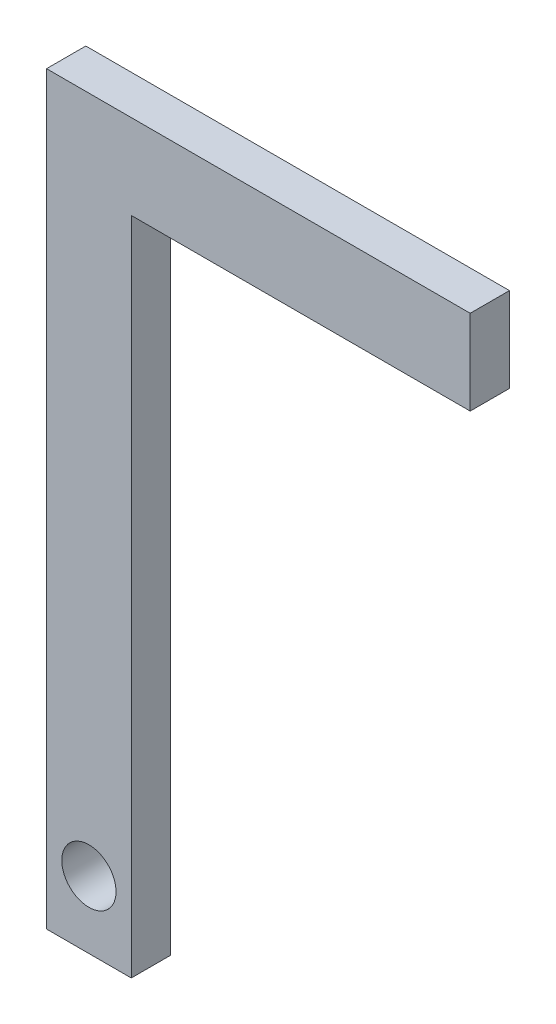
ISO-10303-21;
HEADER;
FILE_DESCRIPTION(('STEP AP214'),'2;1');
FILE_NAME('part.step','',(''),(''),'','','');
FILE_SCHEMA(('AUTOMOTIVE_DESIGN { 1 0 10303 214 1 1 1 1 }'));
ENDSEC;
DATA;
#1=APPLICATION_CONTEXT('core data for automotive mechanical design processes');
#2=APPLICATION_PROTOCOL_DEFINITION('international standard','automotive_design',2000,#1);
#3=PRODUCT_CONTEXT('',#1,'mechanical');
#4=PRODUCT('Part','Part','',(#3));
#5=PRODUCT_RELATED_PRODUCT_CATEGORY('part','',(#4));
#6=PRODUCT_DEFINITION_FORMATION('','',#4);
#7=PRODUCT_DEFINITION_CONTEXT('part definition',#1,'design');
#8=PRODUCT_DEFINITION('design','',#6,#7);
#9=PRODUCT_DEFINITION_SHAPE('','',#8);
#10=(LENGTH_UNIT() NAMED_UNIT(*) SI_UNIT(.MILLI.,.METRE.));
#11=(NAMED_UNIT(*) PLANE_ANGLE_UNIT() SI_UNIT($,.RADIAN.));
#12=(NAMED_UNIT(*) SI_UNIT($,.STERADIAN.) SOLID_ANGLE_UNIT());
#13=UNCERTAINTY_MEASURE_WITH_UNIT(LENGTH_MEASURE(1.E-05),#10,'distance_accuracy_value','');
#14=(GEOMETRIC_REPRESENTATION_CONTEXT(3) GLOBAL_UNCERTAINTY_ASSIGNED_CONTEXT((#13)) GLOBAL_UNIT_ASSIGNED_CONTEXT((#10,
#11,#12)) REPRESENTATION_CONTEXT('',''));
#15=CARTESIAN_POINT('',(0.,0.,0.));
#16=DIRECTION('',(0.,0.,1.));
#17=DIRECTION('',(1.,0.,0.));
#18=AXIS2_PLACEMENT_3D('',#15,#16,#17);
#19=CARTESIAN_POINT('',(3.71819251671082,65.9563637903829,6.95));
#20=DIRECTION('',(1.,0.,0.));
#21=DIRECTION('',(0.,1.,0.));
#22=AXIS2_PLACEMENT_3D('',#19,#20,#21);
#23=PLANE('',#22);
#24=DIRECTION('',(0.,0.,-1.));
#25=VECTOR('',#24,1.);
#26=CARTESIAN_POINT('',(3.71819251671082,50.9563637903829,6.95));
#27=LINE('',#26,#25);
#28=CARTESIAN_POINT('',(3.71819251671082,50.9563637903829,6.95));
#29=VERTEX_POINT('',#28);
#30=CARTESIAN_POINT('',(3.71819251671082,50.9563637903829,0.));
#31=VERTEX_POINT('',#30);
#32=EDGE_CURVE('E51',#29,#31,#27,.T.);
#33=ORIENTED_EDGE('',*,*,#32,.F.);
#34=DIRECTION('',(0.,-1.,0.));
#35=VECTOR('',#34,1.);
#36=CARTESIAN_POINT('',(3.71819251671082,65.9563637903829,6.95));
#37=LINE('',#36,#35);
#38=CARTESIAN_POINT('',(3.71819251671084,-65.9563637903829,6.95));
#39=VERTEX_POINT('',#38);
#40=EDGE_CURVE('E75',#29,#39,#37,.T.);
#41=ORIENTED_EDGE('',*,*,#40,.T.);
#42=DIRECTION('',(0.,0.,-1.));
#43=VECTOR('',#42,1.);
#44=CARTESIAN_POINT('',(3.71819251671084,-65.9563637903829,6.95));
#45=LINE('',#44,#43);
#46=CARTESIAN_POINT('',(3.71819251671084,-65.9563637903829,0.));
#47=VERTEX_POINT('',#46);
#48=EDGE_CURVE('E38',#39,#47,#45,.T.);
#49=ORIENTED_EDGE('',*,*,#48,.T.);
#50=DIRECTION('',(0.,-1.,0.));
#51=VECTOR('',#50,1.);
#52=CARTESIAN_POINT('',(3.71819251671082,65.9563637903829,0.));
#53=LINE('',#52,#51);
#54=EDGE_CURVE('E122',#31,#47,#53,.T.);
#55=ORIENTED_EDGE('',*,*,#54,.F.);
#56=EDGE_LOOP('',(#33,#41,#49,#55));
#57=FACE_BOUND('',#56,.T.);
#58=ADVANCED_FACE('F35',(#57),#23,.T.);
#59=CARTESIAN_POINT('',(-11.2818074832892,65.9563637903829,6.95));
#60=DIRECTION('',(0.,1.,0.));
#61=DIRECTION('',(0.,0.,1.));
#62=AXIS2_PLACEMENT_3D('',#59,#60,#61);
#63=PLANE('',#62);
#64=DIRECTION('',(1.,0.,0.));
#65=VECTOR('',#64,1.);
#66=CARTESIAN_POINT('',(-11.2818074832892,65.9563637903829,0.));
#67=LINE('',#66,#65);
#68=CARTESIAN_POINT('',(-11.2818074832892,65.9563637903829,0.));
#69=VERTEX_POINT('',#68);
#70=CARTESIAN_POINT('',(63.7181925167108,65.9563637903829,0.));
#71=VERTEX_POINT('',#70);
#72=EDGE_CURVE('E125',#69,#71,#67,.T.);
#73=ORIENTED_EDGE('',*,*,#72,.F.);
#74=DIRECTION('',(0.,0.,-1.));
#75=VECTOR('',#74,1.);
#76=CARTESIAN_POINT('',(-11.2818074832892,65.9563637903829,6.95));
#77=LINE('',#76,#75);
#78=CARTESIAN_POINT('',(-11.2818074832892,65.9563637903829,6.95));
#79=VERTEX_POINT('',#78);
#80=EDGE_CURVE('E11',#79,#69,#77,.T.);
#81=ORIENTED_EDGE('',*,*,#80,.F.);
#82=DIRECTION('',(1.,0.,0.));
#83=VECTOR('',#82,1.);
#84=CARTESIAN_POINT('',(-11.2818074832892,65.9563637903829,6.95));
#85=LINE('',#84,#83);
#86=CARTESIAN_POINT('',(63.7181925167108,65.9563637903829,6.95));
#87=VERTEX_POINT('',#86);
#88=EDGE_CURVE('E129',#79,#87,#85,.T.);
#89=ORIENTED_EDGE('',*,*,#88,.T.);
#90=DIRECTION('',(0.,0.,-1.));
#91=VECTOR('',#90,1.);
#92=CARTESIAN_POINT('',(63.7181925167108,65.9563637903829,6.95));
#93=LINE('',#92,#91);
#94=EDGE_CURVE('E110',#87,#71,#93,.T.);
#95=ORIENTED_EDGE('',*,*,#94,.T.);
#96=EDGE_LOOP('',(#73,#81,#89,#95));
#97=FACE_BOUND('',#96,.T.);
#98=ADVANCED_FACE('F146',(#97),#63,.T.);
#99=CARTESIAN_POINT('',(-11.2818074832892,65.9563637903829,6.95));
#100=DIRECTION('',(1.,0.,0.));
#101=DIRECTION('',(0.,1.,0.));
#102=AXIS2_PLACEMENT_3D('',#99,#100,#101);
#103=PLANE('',#102);
#104=DIRECTION('',(0.,-1.,0.));
#105=VECTOR('',#104,1.);
#106=CARTESIAN_POINT('',(-11.2818074832892,65.9563637903829,0.));
#107=LINE('',#106,#105);
#108=CARTESIAN_POINT('',(-11.2818074832892,-65.9563637903829,0.));
#109=VERTEX_POINT('',#108);
#110=EDGE_CURVE('E135',#69,#109,#107,.T.);
#111=ORIENTED_EDGE('',*,*,#110,.T.);
#112=DIRECTION('',(0.,0.,-1.));
#113=VECTOR('',#112,1.);
#114=CARTESIAN_POINT('',(-11.2818074832892,-65.9563637903829,6.95));
#115=LINE('',#114,#113);
#116=CARTESIAN_POINT('',(-11.2818074832892,-65.9563637903829,6.95));
#117=VERTEX_POINT('',#116);
#118=EDGE_CURVE('E43',#117,#109,#115,.T.);
#119=ORIENTED_EDGE('',*,*,#118,.F.);
#120=DIRECTION('',(0.,-1.,0.));
#121=VECTOR('',#120,1.);
#122=CARTESIAN_POINT('',(-11.2818074832892,65.9563637903829,6.95));
#123=LINE('',#122,#121);
#124=EDGE_CURVE('E127',#79,#117,#123,.T.);
#125=ORIENTED_EDGE('',*,*,#124,.F.);
#126=ORIENTED_EDGE('',*,*,#80,.T.);
#127=EDGE_LOOP('',(#111,#119,#125,#126));
#128=FACE_BOUND('',#127,.T.);
#129=ADVANCED_FACE('F147',(#128),#103,.F.);
#130=CARTESIAN_POINT('',(-11.2818074832892,-65.9563637903829,6.95));
#131=DIRECTION('',(0.,1.,0.));
#132=DIRECTION('',(0.,0.,1.));
#133=AXIS2_PLACEMENT_3D('',#130,#131,#132);
#134=PLANE('',#133);
#135=DIRECTION('',(1.,0.,0.));
#136=VECTOR('',#135,1.);
#137=CARTESIAN_POINT('',(-11.2818074832892,-65.9563637903829,0.));
#138=LINE('',#137,#136);
#139=EDGE_CURVE('E132',#109,#47,#138,.T.);
#140=ORIENTED_EDGE('',*,*,#139,.T.);
#141=ORIENTED_EDGE('',*,*,#48,.F.);
#142=DIRECTION('',(1.,0.,0.));
#143=VECTOR('',#142,1.);
#144=CARTESIAN_POINT('',(-11.2818074832892,-65.9563637903829,6.95));
#145=LINE('',#144,#143);
#146=EDGE_CURVE('E124',#117,#39,#145,.T.);
#147=ORIENTED_EDGE('',*,*,#146,.F.);
#148=ORIENTED_EDGE('',*,*,#118,.T.);
#149=EDGE_LOOP('',(#140,#141,#147,#148));
#150=FACE_BOUND('',#149,.T.);
#151=ADVANCED_FACE('F143',(#150),#134,.F.);
#152=CARTESIAN_POINT('',(0.,0.,6.95));
#153=DIRECTION('',(0.,0.,1.));
#154=DIRECTION('',(1.,0.,0.));
#155=AXIS2_PLACEMENT_3D('',#152,#153,#154);
#156=PLANE('',#155);
#157=CARTESIAN_POINT('',(-3.78180748328916,-54.0730128123559,6.95));
#158=DIRECTION('',(0.,0.,1.));
#159=DIRECTION('',(1.,0.,0.));
#160=AXIS2_PLACEMENT_3D('',#157,#158,#159);
#161=CIRCLE('',#160,4.8);
#162=CARTESIAN_POINT('',(1.01819251671084,-54.0730128123559,6.95));
#163=VERTEX_POINT('',#162);
#164=EDGE_CURVE('E119',#163,#163,#161,.T.);
#165=ORIENTED_EDGE('',*,*,#164,.F.);
#166=EDGE_LOOP('',(#165));
#167=FACE_BOUND('',#166,.T.);
#168=ORIENTED_EDGE('',*,*,#40,.F.);
#169=DIRECTION('',(1.,0.,0.));
#170=VECTOR('',#169,1.);
#171=CARTESIAN_POINT('',(3.71819251671082,50.9563637903829,6.95));
#172=LINE('',#171,#170);
#173=CARTESIAN_POINT('',(63.7181925167108,50.9563637903829,6.95));
#174=VERTEX_POINT('',#173);
#175=EDGE_CURVE('E92',#29,#174,#172,.T.);
#176=ORIENTED_EDGE('',*,*,#175,.T.);
#177=DIRECTION('',(0.,1.,0.));
#178=VECTOR('',#177,1.);
#179=CARTESIAN_POINT('',(63.7181925167108,65.9563637903829,6.95));
#180=LINE('',#179,#178);
#181=EDGE_CURVE('E97',#174,#87,#180,.T.);
#182=ORIENTED_EDGE('',*,*,#181,.T.);
#183=ORIENTED_EDGE('',*,*,#88,.F.);
#184=ORIENTED_EDGE('',*,*,#124,.T.);
#185=ORIENTED_EDGE('',*,*,#146,.T.);
#186=EDGE_LOOP('',(#168,#176,#182,#183,#184,#185));
#187=FACE_BOUND('',#186,.T.);
#188=ADVANCED_FACE('F94',(#167,#187),#156,.T.);
#189=CARTESIAN_POINT('',(0.,0.,0.));
#190=DIRECTION('',(0.,0.,1.));
#191=DIRECTION('',(1.,0.,0.));
#192=AXIS2_PLACEMENT_3D('',#189,#190,#191);
#193=PLANE('',#192);
#194=CARTESIAN_POINT('',(-3.78180748328916,-54.0730128123559,0.));
#195=DIRECTION('',(0.,0.,1.));
#196=DIRECTION('',(1.,0.,0.));
#197=AXIS2_PLACEMENT_3D('',#194,#195,#196);
#198=CIRCLE('',#197,4.8);
#199=CARTESIAN_POINT('',(1.01819251671084,-54.0730128123559,0.));
#200=VERTEX_POINT('',#199);
#201=EDGE_CURVE('E219',#200,#200,#198,.T.);
#202=ORIENTED_EDGE('',*,*,#201,.T.);
#203=EDGE_LOOP('',(#202));
#204=FACE_BOUND('',#203,.T.);
#205=ORIENTED_EDGE('',*,*,#72,.T.);
#206=DIRECTION('',(0.,1.,0.));
#207=VECTOR('',#206,1.);
#208=CARTESIAN_POINT('',(63.7181925167108,65.9563637903829,0.));
#209=LINE('',#208,#207);
#210=CARTESIAN_POINT('',(63.7181925167108,50.9563637903829,0.));
#211=VERTEX_POINT('',#210);
#212=EDGE_CURVE('E100',#211,#71,#209,.T.);
#213=ORIENTED_EDGE('',*,*,#212,.F.);
#214=DIRECTION('',(1.,0.,0.));
#215=VECTOR('',#214,1.);
#216=CARTESIAN_POINT('',(3.71819251671082,50.9563637903829,0.));
#217=LINE('',#216,#215);
#218=EDGE_CURVE('E106',#31,#211,#217,.T.);
#219=ORIENTED_EDGE('',*,*,#218,.F.);
#220=ORIENTED_EDGE('',*,*,#54,.T.);
#221=ORIENTED_EDGE('',*,*,#139,.F.);
#222=ORIENTED_EDGE('',*,*,#110,.F.);
#223=EDGE_LOOP('',(#205,#213,#219,#220,#221,#222));
#224=FACE_BOUND('',#223,.T.);
#225=ADVANCED_FACE('F145',(#204,#224),#193,.F.);
#226=CARTESIAN_POINT('',(3.71819251671082,50.9563637903829,6.95));
#227=DIRECTION('',(0.,1.,0.));
#228=DIRECTION('',(0.,0.,1.));
#229=AXIS2_PLACEMENT_3D('',#226,#227,#228);
#230=PLANE('',#229);
#231=ORIENTED_EDGE('',*,*,#218,.T.);
#232=DIRECTION('',(0.,0.,-1.));
#233=VECTOR('',#232,1.);
#234=CARTESIAN_POINT('',(63.7181925167108,50.9563637903829,6.95));
#235=LINE('',#234,#233);
#236=EDGE_CURVE('E103',#174,#211,#235,.T.);
#237=ORIENTED_EDGE('',*,*,#236,.F.);
#238=ORIENTED_EDGE('',*,*,#175,.F.);
#239=ORIENTED_EDGE('',*,*,#32,.T.);
#240=EDGE_LOOP('',(#231,#237,#238,#239));
#241=FACE_BOUND('',#240,.T.);
#242=ADVANCED_FACE('F104',(#241),#230,.F.);
#243=CARTESIAN_POINT('',(63.7181925167108,65.9563637903829,6.95));
#244=DIRECTION('',(-1.,0.,0.));
#245=DIRECTION('',(0.,0.,1.));
#246=AXIS2_PLACEMENT_3D('',#243,#244,#245);
#247=PLANE('',#246);
#248=ORIENTED_EDGE('',*,*,#212,.T.);
#249=ORIENTED_EDGE('',*,*,#94,.F.);
#250=ORIENTED_EDGE('',*,*,#181,.F.);
#251=ORIENTED_EDGE('',*,*,#236,.T.);
#252=EDGE_LOOP('',(#248,#249,#250,#251));
#253=FACE_BOUND('',#252,.T.);
#254=ADVANCED_FACE('F112',(#253),#247,.F.);
#255=CARTESIAN_POINT('',(-3.78180748328916,-54.0730128123559,6.95));
#256=DIRECTION('',(0.,0.,-1.));
#257=DIRECTION('',(-1.,0.,0.));
#258=AXIS2_PLACEMENT_3D('',#255,#256,#257);
#259=CYLINDRICAL_SURFACE('',#258,4.8);
#260=ORIENTED_EDGE('',*,*,#164,.T.);
#261=EDGE_LOOP('',(#260));
#262=FACE_BOUND('',#261,.T.);
#263=ORIENTED_EDGE('',*,*,#201,.F.);
#264=EDGE_LOOP('',(#263));
#265=FACE_BOUND('',#264,.T.);
#266=ADVANCED_FACE('F185',(#262,#265),#259,.F.);
#267=CLOSED_SHELL('',(#58,#98,#129,#151,#188,#225,#242,#254,#266));
#268=MANIFOLD_SOLID_BREP('B2',#267);
#269=ADVANCED_BREP_SHAPE_REPRESENTATION('',(#18,#268),#14);
#270=SHAPE_DEFINITION_REPRESENTATION(#9,#269);
ENDSEC;
END-ISO-10303-21;
